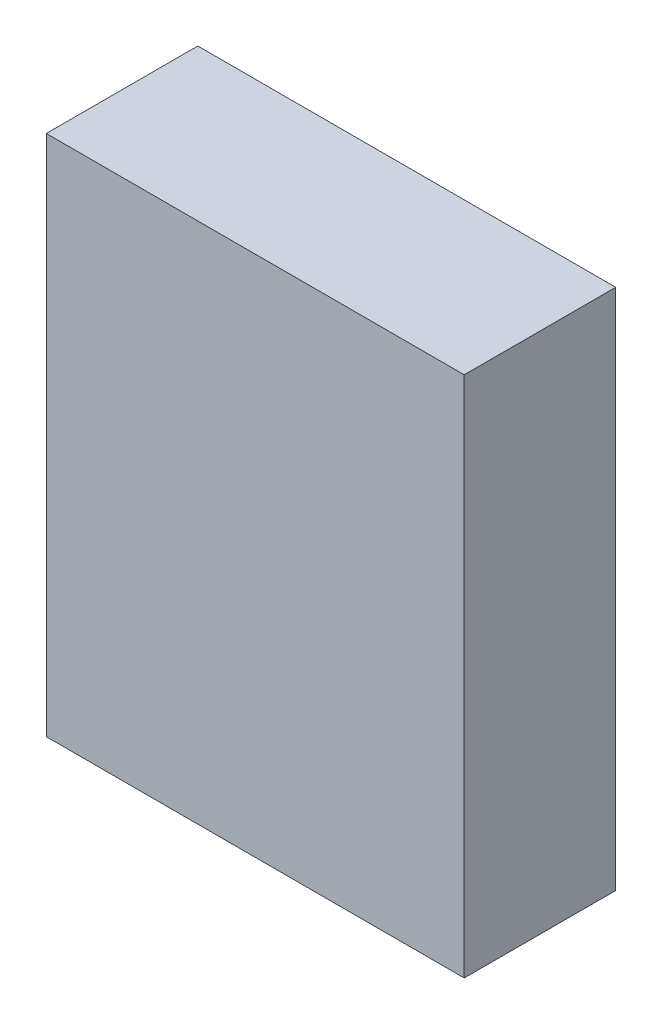
ISO-10303-21;
HEADER;
FILE_DESCRIPTION(('STEP AP214'),'2;1');
FILE_NAME('part.step','',(''),(''),'','','');
FILE_SCHEMA(('AUTOMOTIVE_DESIGN { 1 0 10303 214 1 1 1 1 }'));
ENDSEC;
DATA;
#1=APPLICATION_CONTEXT('core data for automotive mechanical design processes');
#2=APPLICATION_PROTOCOL_DEFINITION('international standard','automotive_design',2000,#1);
#3=PRODUCT_CONTEXT('',#1,'mechanical');
#4=PRODUCT('Part','Part','',(#3));
#5=PRODUCT_RELATED_PRODUCT_CATEGORY('part','',(#4));
#6=PRODUCT_DEFINITION_FORMATION('','',#4);
#7=PRODUCT_DEFINITION_CONTEXT('part definition',#1,'design');
#8=PRODUCT_DEFINITION('design','',#6,#7);
#9=PRODUCT_DEFINITION_SHAPE('','',#8);
#10=(LENGTH_UNIT() NAMED_UNIT(*) SI_UNIT(.MILLI.,.METRE.));
#11=(NAMED_UNIT(*) PLANE_ANGLE_UNIT() SI_UNIT($,.RADIAN.));
#12=(NAMED_UNIT(*) SI_UNIT($,.STERADIAN.) SOLID_ANGLE_UNIT());
#13=UNCERTAINTY_MEASURE_WITH_UNIT(LENGTH_MEASURE(1.E-05),#10,'distance_accuracy_value','');
#14=(GEOMETRIC_REPRESENTATION_CONTEXT(3) GLOBAL_UNCERTAINTY_ASSIGNED_CONTEXT((#13)) GLOBAL_UNIT_ASSIGNED_CONTEXT((#10,
#11,#12)) REPRESENTATION_CONTEXT('',''));
#15=CARTESIAN_POINT('',(0.,0.,0.));
#16=DIRECTION('',(0.,0.,1.));
#17=DIRECTION('',(1.,0.,0.));
#18=AXIS2_PLACEMENT_3D('',#15,#16,#17);
#19=CARTESIAN_POINT('',(40.,-50.,29.));
#20=DIRECTION('',(-1.,0.,0.));
#21=DIRECTION('',(0.,0.,1.));
#22=AXIS2_PLACEMENT_3D('',#19,#20,#21);
#23=PLANE('',#22);
#24=DIRECTION('',(0.,1.,0.));
#25=VECTOR('',#24,1.);
#26=CARTESIAN_POINT('',(40.,-50.,0.));
#27=LINE('',#26,#25);
#28=CARTESIAN_POINT('',(40.,-50.,0.));
#29=VERTEX_POINT('',#28);
#30=CARTESIAN_POINT('',(40.,50.,0.));
#31=VERTEX_POINT('',#30);
#32=EDGE_CURVE('E111',#29,#31,#27,.T.);
#33=ORIENTED_EDGE('',*,*,#32,.T.);
#34=DIRECTION('',(0.,0.,-1.));
#35=VECTOR('',#34,1.);
#36=CARTESIAN_POINT('',(40.,50.,29.));
#37=LINE('',#36,#35);
#38=CARTESIAN_POINT('',(40.,50.,29.));
#39=VERTEX_POINT('',#38);
#40=EDGE_CURVE('E11',#39,#31,#37,.T.);
#41=ORIENTED_EDGE('',*,*,#40,.F.);
#42=DIRECTION('',(0.,1.,0.));
#43=VECTOR('',#42,1.);
#44=CARTESIAN_POINT('',(40.,-50.,29.));
#45=LINE('',#44,#43);
#46=CARTESIAN_POINT('',(40.,-50.,29.));
#47=VERTEX_POINT('',#46);
#48=EDGE_CURVE('E95',#47,#39,#45,.T.);
#49=ORIENTED_EDGE('',*,*,#48,.F.);
#50=DIRECTION('',(0.,0.,-1.));
#51=VECTOR('',#50,1.);
#52=CARTESIAN_POINT('',(40.,-50.,29.));
#53=LINE('',#52,#51);
#54=EDGE_CURVE('E107',#47,#29,#53,.T.);
#55=ORIENTED_EDGE('',*,*,#54,.T.);
#56=EDGE_LOOP('',(#33,#41,#49,#55));
#57=FACE_BOUND('',#56,.T.);
#58=ADVANCED_FACE('F43',(#57),#23,.F.);
#59=CARTESIAN_POINT('',(-40.,50.,29.));
#60=DIRECTION('',(0.,-1.,0.));
#61=DIRECTION('',(0.,0.,-1.));
#62=AXIS2_PLACEMENT_3D('',#59,#60,#61);
#63=PLANE('',#62);
#64=DIRECTION('',(-1.,0.,0.));
#65=VECTOR('',#64,1.);
#66=CARTESIAN_POINT('',(-40.,50.,0.));
#67=LINE('',#66,#65);
#68=CARTESIAN_POINT('',(-40.,50.,0.));
#69=VERTEX_POINT('',#68);
#70=EDGE_CURVE('E100',#31,#69,#67,.T.);
#71=ORIENTED_EDGE('',*,*,#70,.T.);
#72=DIRECTION('',(0.,0.,-1.));
#73=VECTOR('',#72,1.);
#74=CARTESIAN_POINT('',(-40.,50.,29.));
#75=LINE('',#74,#73);
#76=CARTESIAN_POINT('',(-40.,50.,29.));
#77=VERTEX_POINT('',#76);
#78=EDGE_CURVE('E52',#77,#69,#75,.T.);
#79=ORIENTED_EDGE('',*,*,#78,.F.);
#80=DIRECTION('',(-1.,0.,0.));
#81=VECTOR('',#80,1.);
#82=CARTESIAN_POINT('',(-40.,50.,29.));
#83=LINE('',#82,#81);
#84=EDGE_CURVE('E90',#39,#77,#83,.T.);
#85=ORIENTED_EDGE('',*,*,#84,.F.);
#86=ORIENTED_EDGE('',*,*,#40,.T.);
#87=EDGE_LOOP('',(#71,#79,#85,#86));
#88=FACE_BOUND('',#87,.T.);
#89=ADVANCED_FACE('F99',(#88),#63,.F.);
#90=CARTESIAN_POINT('',(-40.,-50.,29.));
#91=DIRECTION('',(1.,0.,0.));
#92=DIRECTION('',(0.,0.,-1.));
#93=AXIS2_PLACEMENT_3D('',#90,#91,#92);
#94=PLANE('',#93);
#95=DIRECTION('',(0.,-1.,0.));
#96=VECTOR('',#95,1.);
#97=CARTESIAN_POINT('',(-40.,-50.,0.));
#98=LINE('',#97,#96);
#99=CARTESIAN_POINT('',(-40.,-50.,0.));
#100=VERTEX_POINT('',#99);
#101=EDGE_CURVE('E77',#69,#100,#98,.T.);
#102=ORIENTED_EDGE('',*,*,#101,.T.);
#103=DIRECTION('',(0.,0.,-1.));
#104=VECTOR('',#103,1.);
#105=CARTESIAN_POINT('',(-40.,-50.,29.));
#106=LINE('',#105,#104);
#107=CARTESIAN_POINT('',(-40.,-50.,29.));
#108=VERTEX_POINT('',#107);
#109=EDGE_CURVE('E102',#108,#100,#106,.T.);
#110=ORIENTED_EDGE('',*,*,#109,.F.);
#111=DIRECTION('',(0.,-1.,0.));
#112=VECTOR('',#111,1.);
#113=CARTESIAN_POINT('',(-40.,-50.,29.));
#114=LINE('',#113,#112);
#115=EDGE_CURVE('E93',#77,#108,#114,.T.);
#116=ORIENTED_EDGE('',*,*,#115,.F.);
#117=ORIENTED_EDGE('',*,*,#78,.T.);
#118=EDGE_LOOP('',(#102,#110,#116,#117));
#119=FACE_BOUND('',#118,.T.);
#120=ADVANCED_FACE('F103',(#119),#94,.F.);
#121=CARTESIAN_POINT('',(-40.,-50.,29.));
#122=DIRECTION('',(0.,1.,0.));
#123=DIRECTION('',(0.,0.,1.));
#124=AXIS2_PLACEMENT_3D('',#121,#122,#123);
#125=PLANE('',#124);
#126=DIRECTION('',(1.,0.,0.));
#127=VECTOR('',#126,1.);
#128=CARTESIAN_POINT('',(-40.,-50.,0.));
#129=LINE('',#128,#127);
#130=EDGE_CURVE('E83',#100,#29,#129,.T.);
#131=ORIENTED_EDGE('',*,*,#130,.T.);
#132=ORIENTED_EDGE('',*,*,#54,.F.);
#133=DIRECTION('',(1.,0.,0.));
#134=VECTOR('',#133,1.);
#135=CARTESIAN_POINT('',(-40.,-50.,29.));
#136=LINE('',#135,#134);
#137=EDGE_CURVE('E60',#108,#47,#136,.T.);
#138=ORIENTED_EDGE('',*,*,#137,.F.);
#139=ORIENTED_EDGE('',*,*,#109,.T.);
#140=EDGE_LOOP('',(#131,#132,#138,#139));
#141=FACE_BOUND('',#140,.T.);
#142=ADVANCED_FACE('F124',(#141),#125,.F.);
#143=CARTESIAN_POINT('',(0.,0.,29.));
#144=DIRECTION('',(0.,0.,-1.));
#145=DIRECTION('',(-1.,0.,0.));
#146=AXIS2_PLACEMENT_3D('',#143,#144,#145);
#147=PLANE('',#146);
#148=ORIENTED_EDGE('',*,*,#48,.T.);
#149=ORIENTED_EDGE('',*,*,#84,.T.);
#150=ORIENTED_EDGE('',*,*,#115,.T.);
#151=ORIENTED_EDGE('',*,*,#137,.T.);
#152=EDGE_LOOP('',(#148,#149,#150,#151));
#153=FACE_BOUND('',#152,.T.);
#154=ADVANCED_FACE('F91',(#153),#147,.F.);
#155=CARTESIAN_POINT('',(0.,0.,0.));
#156=DIRECTION('',(0.,0.,-1.));
#157=DIRECTION('',(-1.,0.,0.));
#158=AXIS2_PLACEMENT_3D('',#155,#156,#157);
#159=PLANE('',#158);
#160=ORIENTED_EDGE('',*,*,#32,.F.);
#161=ORIENTED_EDGE('',*,*,#130,.F.);
#162=ORIENTED_EDGE('',*,*,#101,.F.);
#163=ORIENTED_EDGE('',*,*,#70,.F.);
#164=EDGE_LOOP('',(#160,#161,#162,#163));
#165=FACE_BOUND('',#164,.T.);
#166=ADVANCED_FACE('F127',(#165),#159,.T.);
#167=CLOSED_SHELL('',(#58,#89,#120,#142,#154,#166));
#168=MANIFOLD_SOLID_BREP('B2',#167);
#169=ADVANCED_BREP_SHAPE_REPRESENTATION('',(#18,#168),#14);
#170=SHAPE_DEFINITION_REPRESENTATION(#9,#169);
ENDSEC;
END-ISO-10303-21;
